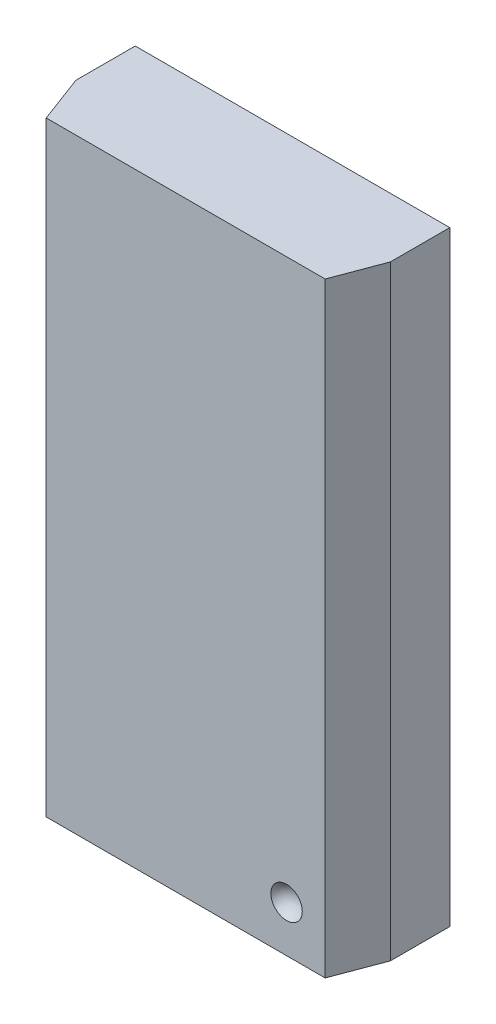
ISO-10303-21;
HEADER;
FILE_DESCRIPTION(('STEP AP214'),'2;1');
FILE_NAME('part.step','',(''),(''),'','','');
FILE_SCHEMA(('AUTOMOTIVE_DESIGN { 1 0 10303 214 1 1 1 1 }'));
ENDSEC;
DATA;
#1=APPLICATION_CONTEXT('core data for automotive mechanical design processes');
#2=APPLICATION_PROTOCOL_DEFINITION('international standard','automotive_design',2000,#1);
#3=PRODUCT_CONTEXT('',#1,'mechanical');
#4=PRODUCT('Part','Part','',(#3));
#5=PRODUCT_RELATED_PRODUCT_CATEGORY('part','',(#4));
#6=PRODUCT_DEFINITION_FORMATION('','',#4);
#7=PRODUCT_DEFINITION_CONTEXT('part definition',#1,'design');
#8=PRODUCT_DEFINITION('design','',#6,#7);
#9=PRODUCT_DEFINITION_SHAPE('','',#8);
#10=(LENGTH_UNIT() NAMED_UNIT(*) SI_UNIT(.MILLI.,.METRE.));
#11=(NAMED_UNIT(*) PLANE_ANGLE_UNIT() SI_UNIT($,.RADIAN.));
#12=(NAMED_UNIT(*) SI_UNIT($,.STERADIAN.) SOLID_ANGLE_UNIT());
#13=UNCERTAINTY_MEASURE_WITH_UNIT(LENGTH_MEASURE(1.E-05),#10,'distance_accuracy_value','');
#14=(GEOMETRIC_REPRESENTATION_CONTEXT(3) GLOBAL_UNCERTAINTY_ASSIGNED_CONTEXT((#13)) GLOBAL_UNIT_ASSIGNED_CONTEXT((#10,
#11,#12)) REPRESENTATION_CONTEXT('',''));
#15=CARTESIAN_POINT('',(0.,0.,0.));
#16=DIRECTION('',(0.,0.,1.));
#17=DIRECTION('',(1.,0.,0.));
#18=AXIS2_PLACEMENT_3D('',#15,#16,#17);
#19=CARTESIAN_POINT('',(1.59694277202488,-4.58817753292736,1.87268785101428));
#20=CARTESIAN_POINT('',(1.64216718875779,-4.58817753292736,1.76585007048859));
#21=CARTESIAN_POINT('',(1.75818245081433,-4.58817753292736,1.7659849276044));
#22=CARTESIAN_POINT('',(1.8031583674009,-4.58817753292736,1.87292755775573));
#23=CARTESIAN_POINT('',(1.34005004997247,-4.47097835084961,1.76394519967328));
#24=CARTESIAN_POINT('',(1.49800623473388,-4.47097835084961,1.39079084148934));
#25=CARTESIAN_POINT('',(1.90321495808281,-4.47097835084961,1.39126185951542));
#26=CARTESIAN_POINT('',(2.06030320163315,-4.47097835084961,1.764782427991));
#27=CARTESIAN_POINT('',(1.34156158465533,-4.16840308910263,1.76458503208151));
#28=CARTESIAN_POINT('',(1.498854465389,-4.16840308910263,1.39299765773633));
#29=CARTESIAN_POINT('',(1.90236159928336,-4.16840308910263,1.39346669782052));
#30=CARTESIAN_POINT('',(2.05879018354391,-4.16840308910263,1.76541874463367));
#31=CARTESIAN_POINT('',(1.59961010586653,-4.05423726383752,1.87381693303589));
#32=CARTESIAN_POINT('',(1.64366402131981,-4.05423726383752,1.76974433485755));
#33=CARTESIAN_POINT('',(1.75667656885828,-4.05423726383752,1.76987570159276));
#34=CARTESIAN_POINT('',(1.80048841586208,-4.05423726383752,1.87405043567195));
#35=(BOUNDED_SURFACE() B_SPLINE_SURFACE(3,3,((#19,#20,#21,#22),(#23,#24,#25,#26),(#27,#28,#29,
#30),(#31,#32,#33,#34)),.UNSPECIFIED.,.F.,.F.,.F.) B_SPLINE_SURFACE_WITH_KNOTS((4,4),(4,4),(0.,
1.),(0.,1.),.UNSPECIFIED.) GEOMETRIC_REPRESENTATION_ITEM() RATIONAL_B_SPLINE_SURFACE(((1.,
0.592495595609752,0.592495595609752,1.),(0.588217584838267,0.348516328276879,0.348516328276879,
0.588217584838267),(0.588217584838267,0.348516328276879,0.348516328276879,0.588217584838267),
(1.,0.592495595609752,0.592495595609752,1.))) REPRESENTATION_ITEM('') SURFACE());
#36=CARTESIAN_POINT('',(1.96447842560012,-4.32171313154078,1.80000000000028));
#37=CARTESIAN_POINT('',(1.96447728753263,-4.31838963170653,1.80000001262232));
#38=CARTESIAN_POINT('',(1.96441451224342,-4.315066139045,1.80000245878868));
#39=CARTESIAN_POINT('',(1.96416669474467,-4.3084576558505,1.8000110646047));
#40=CARTESIAN_POINT('',(1.96398290552865,-4.30517261821554,1.80001718614244));
#41=CARTESIAN_POINT('',(1.9634966485052,-4.29864656048071,1.80003195548272));
#42=CARTESIAN_POINT('',(1.9631954669972,-4.29540544451496,1.80004057565314));
#43=CARTESIAN_POINT('',(1.96247839642698,-4.2889723613424,1.80005930785607));
#44=CARTESIAN_POINT('',(1.96206381806036,-4.28578024798487,1.8000694022622));
#45=CARTESIAN_POINT('',(1.96112419202656,-4.27944988685185,1.80009017662881));
#46=CARTESIAN_POINT('',(1.9606004714086,-4.27631144207713,1.80010084850801));
#47=CARTESIAN_POINT('',(1.95944703881737,-4.27009271396852,1.80012200407324));
#48=CARTESIAN_POINT('',(1.95881866225767,-4.26701218294202,1.80013248848755));
#49=CARTESIAN_POINT('',(1.95746058554247,-4.26091315063053,1.80015262353895));
#50=CARTESIAN_POINT('',(1.95673222157607,-4.25789435183175,1.80016228281985));
#51=CARTESIAN_POINT('',(1.95517898520179,-4.25192222399201,1.80018024710359));
#52=CARTESIAN_POINT('',(1.95435544258135,-4.24896854912622,1.80018856761889));
#53=CARTESIAN_POINT('',(1.95261676925393,-4.24312968404578,1.80020345465584));
#54=CARTESIAN_POINT('',(1.95170295525224,-4.24024410177595,1.80021004239447));
#55=CARTESIAN_POINT('',(1.94978872518747,-4.23454401874528,1.80022118025014));
#56=CARTESIAN_POINT('',(1.94878960661037,-4.23172908227304,1.80022575603369));
#57=CARTESIAN_POINT('',(1.94670978201727,-4.22617248013593,1.80023269727542));
#58=CARTESIAN_POINT('',(1.94563034871328,-4.223430338093,1.80023509153108));
#59=CARTESIAN_POINT('',(1.94339490367646,-4.21802112001746,1.80023760246911));
#60=CARTESIAN_POINT('',(1.94224013493323,-4.21535353026608,1.80023774972271));
#61=CARTESIAN_POINT('',(1.93985899118724,-4.21009483384692,1.80023579918783));
#62=CARTESIAN_POINT('',(1.93863382512152,-4.20750317970491,1.80023373237143));
#63=CARTESIAN_POINT('',(1.93611679404825,-4.20239741159925,1.80022748021666));
#64=CARTESIAN_POINT('',(1.93482610021238,-4.1998827201745,1.8002233248835));
#65=CARTESIAN_POINT('',(1.93218283093036,-4.19493159408113,1.80021311041599));
#66=CARTESIAN_POINT('',(1.93083138578946,-4.19249455585088,1.80020707897545));
#67=CARTESIAN_POINT('',(1.92807132043073,-4.18769913420764,1.80019340941177));
#68=CARTESIAN_POINT('',(1.92666378712757,-4.18534012505309,1.80018579536664));
#69=CARTESIAN_POINT('',(1.9237961193707,-4.18070085929119,1.80016933471427));
#70=CARTESIAN_POINT('',(1.92233702652648,-4.17841995872413,1.80016050731443));
#71=CARTESIAN_POINT('',(1.91937067737575,-4.17393674337793,1.80014206485633));
#72=CARTESIAN_POINT('',(1.91786441582027,-4.17173377012607,1.80013246295508));
#73=CARTESIAN_POINT('',(1.91480797477914,-4.16740595164748,1.80011298488993));
#74=CARTESIAN_POINT('',(1.91325874274912,-4.16528043773412,1.80010311468349));
#75=CARTESIAN_POINT('',(1.91012056268004,-4.1611069910638,1.80008366639348));
#76=CARTESIAN_POINT('',(1.90853251253924,-4.15905838097272,1.80007408614963));
#77=CARTESIAN_POINT('',(1.9037492055295,-4.15307090281385,1.80004696250654));
#78=CARTESIAN_POINT('',(1.9004697469792,-4.14919853952155,1.80003056866547));
#79=CARTESIAN_POINT('',(1.89542693363786,-4.14357575552709,1.80001255333211));
#80=CARTESIAN_POINT('',(1.89374471934441,-4.14175171156943,1.80000766344338));
#81=CARTESIAN_POINT('',(1.89035527492868,-4.13817637272944,1.80000160317097));
#82=CARTESIAN_POINT('',(1.88864875193605,-4.13642440902473,1.80000038033407));
#83=CARTESIAN_POINT('',(1.88451028580023,-4.13229075578714,1.79999947064995));
#84=CARTESIAN_POINT('',(1.88205608843532,-4.12993128092376,1.80000057332496));
#85=CARTESIAN_POINT('',(1.87713750802628,-4.12538265832802,1.80000155337605));
#86=CARTESIAN_POINT('',(1.87467592457072,-4.12319048093511,1.80000146855918));
#87=CARTESIAN_POINT('',(1.86975121609557,-4.1189673874296,1.80000084045628));
#88=CARTESIAN_POINT('',(1.86729058158533,-4.11693356685693,1.80000031169454));
#89=CARTESIAN_POINT('',(1.86237476376204,-4.11301854762314,1.799998336808));
#90=CARTESIAN_POINT('',(1.85992179402098,-4.1111345689952,1.7999969197449));
#91=CARTESIAN_POINT('',(1.85502719520591,-4.10751052695507,1.79999318183108));
#92=CARTESIAN_POINT('',(1.85258752102228,-4.10576782278098,1.79999088999917));
#93=CARTESIAN_POINT('',(1.84772427137791,-4.10241780085942,1.79998544213194));
#94=CARTESIAN_POINT('',(1.84530241379946,-4.10080798874107,1.79998231412484));
#95=CARTESIAN_POINT('',(1.84047854357534,-4.0977154315357,1.79997536888789));
#96=CARTESIAN_POINT('',(1.83807803203342,-4.0962303444771,1.79997157456206));
#97=CARTESIAN_POINT('',(1.83329966578405,-4.09337919888772,1.79996356439305));
#98=CARTESIAN_POINT('',(1.83092311512417,-4.09201095432036,1.79995936364479));
#99=CARTESIAN_POINT('',(1.8261946398181,-4.08938575800985,1.79995095309825));
#100=CARTESIAN_POINT('',(1.82384384070561,-4.08812677859218,1.79994674673807));
#101=CARTESIAN_POINT('',(1.81916805227835,-4.08571277592795,1.79993872977672));
#102=CARTESIAN_POINT('',(1.81684402807039,-4.08455588263353,1.79993491164497));
#103=CARTESIAN_POINT('',(1.81222234094477,-4.08233890350286,1.79992863276084));
#104=CARTESIAN_POINT('',(1.80992549767243,-4.08127710937289,1.79992614012346));
#105=CARTESIAN_POINT('',(1.80535788353773,-4.07924421318437,1.79992204544429));
#106=CARTESIAN_POINT('',(1.80308780760194,-4.07827154720477,1.79992042348522));
#107=CARTESIAN_POINT('',(1.79767722141134,-4.07603892870223,1.79992395033207));
#108=CARTESIAN_POINT('',(1.79452555793486,-4.07480590976565,1.79993182768706));
#109=CARTESIAN_POINT('',(1.78832135571542,-4.07250902178397,1.79995986005971));
#110=CARTESIAN_POINT('',(1.78527070095982,-4.07144004977876,1.79997944928028));
#111=CARTESIAN_POINT('',(1.77926114532082,-4.06945481262306,1.80002289724225));
#112=CARTESIAN_POINT('',(1.77630373527828,-4.06853403365823,1.80004654343802));
#113=CARTESIAN_POINT('',(1.77047155045215,-4.06682990116505,1.80009308249294));
#114=CARTESIAN_POINT('',(1.76759791445186,-4.06604265108598,1.80011596977191));
#115=CARTESIAN_POINT('',(1.76192214840442,-4.06459236489603,1.80015653783994));
#116=CARTESIAN_POINT('',(1.75912085918034,-4.06392604443716,1.80017436770419));
#117=CARTESIAN_POINT('',(1.75357701922797,-4.06270611670374,1.8002017691248));
#118=CARTESIAN_POINT('',(1.75083505524894,-4.06214984915314,1.80021156051204));
#119=CARTESIAN_POINT('',(1.74539565653581,-4.06114019875331,1.80022126659007));
#120=CARTESIAN_POINT('',(1.74269859786264,-4.06068479268409,1.80022139732943));
#121=CARTESIAN_POINT('',(1.73733362606573,-4.05986859977837,1.80021183660787));
#122=CARTESIAN_POINT('',(1.73466592169933,-4.05950643744284,1.80020229959591));
#123=CARTESIAN_POINT('',(1.72934330190236,-4.05886996706827,1.80017528499996));
#124=CARTESIAN_POINT('',(1.72668847319052,-4.05859493174945,1.80015787626315));
#125=CARTESIAN_POINT('',(1.72137479716266,-4.05812736678646,1.80011903670423));
#126=CARTESIAN_POINT('',(1.71871595796997,-4.05793474269773,1.80009761052691));
#127=CARTESIAN_POINT('',(1.71066270682943,-4.05747230425462,1.80003575752337));
#128=CARTESIAN_POINT('',(1.70526059375794,-4.05732607517216,1.79999839177467));
#129=CARTESIAN_POINT('',(1.69714409821811,-4.05732929088231,1.80000080856573));
#130=CARTESIAN_POINT('',(1.69442890419356,-4.0573678709316,1.80001146884006));
#131=CARTESIAN_POINT('',(1.68903582681769,-4.05752354232483,1.80004183839399));
#132=CARTESIAN_POINT('',(1.68635791544734,-4.05763961093691,1.8000614287551));
#133=CARTESIAN_POINT('',(1.68102228660717,-4.05795167921069,1.80010164870628));
#134=CARTESIAN_POINT('',(1.67836454181789,-4.05814721347308,1.80012227164261));
#135=CARTESIAN_POINT('',(1.67305176164835,-4.05862101435347,1.80015873061526));
#136=CARTESIAN_POINT('',(1.67039673878764,-4.05889942266967,1.80017455835846));
#137=CARTESIAN_POINT('',(1.66507221024387,-4.05954309771667,1.80019791781358));
#138=CARTESIAN_POINT('',(1.66240279857298,-4.05990914596882,1.80020537123295));
#139=CARTESIAN_POINT('',(1.65703284961224,-4.06073365587095,1.80021049151079));
#140=CARTESIAN_POINT('',(1.6543325323709,-4.06119355231965,1.80020799365786));
#141=CARTESIAN_POINT('',(1.64888499593244,-4.06221282384361,1.80019351148227));
#142=CARTESIAN_POINT('',(1.64613816767734,-4.06277428452413,1.80018130538614));
#143=CARTESIAN_POINT('',(1.64058295767311,-4.06400535291193,1.80014925564922));
#144=CARTESIAN_POINT('',(1.63777518124051,-4.06467768503301,1.80012919522766));
#145=CARTESIAN_POINT('',(1.63208480150131,-4.06614088111347,1.80008456447886));
#146=CARTESIAN_POINT('',(1.62920306110645,-4.06693509465666,1.80005985980988));
#147=CARTESIAN_POINT('',(1.62335305577725,-4.06865418640755,1.80001031015964));
#148=CARTESIAN_POINT('',(1.62038595530577,-4.06958302727127,1.79998549928012));
#149=CARTESIAN_POINT('',(1.61435547054442,-4.07158560234113,1.79994052693302));
#150=CARTESIAN_POINT('',(1.61129360726477,-4.07266391865996,1.79992061861967));
#151=CARTESIAN_POINT('',(1.60506550193075,-4.07498083763565,1.79989311314443));
#152=CARTESIAN_POINT('',(1.60190117780547,-4.07622461082871,1.79988614320591));
#153=CARTESIAN_POINT('',(1.59648540020566,-4.07846973472313,1.79988483599233));
#154=CARTESIAN_POINT('',(1.59422248717997,-4.07944354301104,1.79988754888633));
#155=CARTESIAN_POINT('',(1.58966967613673,-4.08147828097116,1.79989376927941));
#156=CARTESIAN_POINT('',(1.58738046818964,-4.0825407572344,1.79989729456166));
#157=CARTESIAN_POINT('',(1.58277454746101,-4.08475854376306,1.79990567981732));
#158=CARTESIAN_POINT('',(1.58045864732798,-4.08591554128294,1.79991057185992));
#159=CARTESIAN_POINT('',(1.57579963494365,-4.08832912603591,1.79992074365444));
#160=CARTESIAN_POINT('',(1.5734574788928,-4.08958755973857,1.79992603031154));
#161=CARTESIAN_POINT('',(1.56874683390395,-4.09221094549689,1.79993660896536));
#162=CARTESIAN_POINT('',(1.5663794591953,-4.09357789867174,1.79994189692444));
#163=CARTESIAN_POINT('',(1.56161999585176,-4.09642564508946,1.79995207839219));
#164=CARTESIAN_POINT('',(1.55922919723553,-4.09790859488301,1.79995695591667));
#165=CARTESIAN_POINT('',(1.55442529737623,-4.10099595441502,1.79996605547793));
#166=CARTESIAN_POINT('',(1.55201368006104,-4.1026026736421,1.79997025345021));
#167=CARTESIAN_POINT('',(1.54717143443027,-4.10594547226463,1.7999778184759));
#168=CARTESIAN_POINT('',(1.54474250322951,-4.10768401055478,1.79998115599757));
#169=CARTESIAN_POINT('',(1.5398698762256,-4.11129856183645,1.799986950636));
#170=CARTESIAN_POINT('',(1.5374281104735,-4.11317717716404,1.79998937682664));
#171=CARTESIAN_POINT('',(1.5325351297735,-4.11708018295801,1.79999332326076));
#172=CARTESIAN_POINT('',(1.53008609896134,-4.11910731209517,1.79999481212983));
#173=CARTESIAN_POINT('',(1.5251849503557,-4.12331560548431,1.79999729563158));
#174=CARTESIAN_POINT('',(1.52273528856143,-4.12549963028503,1.79999827274461));
#175=CARTESIAN_POINT('',(1.5178407995044,-4.13003039083344,1.79999901095117));
#176=CARTESIAN_POINT('',(1.51539873148983,-4.13238010964625,1.79999873137773));
#177=CARTESIAN_POINT('',(1.51127326241243,-4.13650347924656,1.80000091530177));
#178=CARTESIAN_POINT('',(1.50956798925599,-4.13825531018738,1.80000263651959));
#179=CARTESIAN_POINT('',(1.50618103220596,-4.14183039596865,1.80000960561245));
#180=CARTESIAN_POINT('',(1.50450005663239,-4.1436543202939,1.80001490462973));
#181=CARTESIAN_POINT('',(1.49946089847525,-4.14927683078986,1.80003404257166));
#182=CARTESIAN_POINT('',(1.49618386897366,-4.1531490017354,1.80005102156798));
#183=CARTESIAN_POINT('',(1.49140417251879,-4.15913616979222,1.80007882032973));
#184=CARTESIAN_POINT('',(1.48981730583152,-4.16118471045469,1.8000885929689));
#185=CARTESIAN_POINT('',(1.48668146975714,-4.16535803991047,1.80010836508766));
#186=CARTESIAN_POINT('',(1.48513339991387,-4.16748350679634,1.80011836579036));
#187=CARTESIAN_POINT('',(1.48207925968156,-4.17181125565791,1.80013804911542));
#188=CARTESIAN_POINT('',(1.48057413852108,-4.17401420708135,1.80014772491975));
#189=CARTESIAN_POINT('',(1.47761004649529,-4.17849740599365,1.80016626492453));
#190=CARTESIAN_POINT('',(1.47615207227674,-4.18077831271362,1.80017511518855));
#191=CARTESIAN_POINT('',(1.47328661857439,-4.18541762072762,1.80019157679115));
#192=CARTESIAN_POINT('',(1.47188018271757,-4.18777666672655,1.80019916822538));
#193=CARTESIAN_POINT('',(1.46912229007704,-4.19257219462987,1.80021275333397));
#194=CARTESIAN_POINT('',(1.46777192234372,-4.19500930299874,1.80021872231783));
#195=CARTESIAN_POINT('',(1.46513078727063,-4.19996060441943,1.80022877822308));
#196=CARTESIAN_POINT('',(1.46384115248563,-4.20247540172409,1.80023283692406));
#197=CARTESIAN_POINT('',(1.46132622100579,-4.20758141892366,1.80023886778711));
#198=CARTESIAN_POINT('',(1.46010209784018,-4.21017321692998,1.80024080950442));
#199=CARTESIAN_POINT('',(1.45772302399344,-4.21543224044864,1.80024248746371));
#200=CARTESIAN_POINT('',(1.4565692847078,-4.21810001403567,1.8002421923818));
#201=CARTESIAN_POINT('',(1.45433588577539,-4.22350964088882,1.80023936908035));
#202=CARTESIAN_POINT('',(1.45325747166909,-4.2262520084157,1.80023681002573));
#203=CARTESIAN_POINT('',(1.45117967620034,-4.23180910400533,1.80022952816153));
#204=CARTESIAN_POINT('',(1.45018157018332,-4.23462430892148,1.80022477637817));
#205=CARTESIAN_POINT('',(1.44826935991668,-4.24032497228982,1.80021328118225));
#206=CARTESIAN_POINT('',(1.44735655585767,-4.24321086685451,1.80020651201345));
#207=CARTESIAN_POINT('',(1.44561990140368,-4.24905040047124,1.80019126244977));
#208=CARTESIAN_POINT('',(1.44479737047707,-4.25200443189854,1.80018276083307));
#209=CARTESIAN_POINT('',(1.44324616109355,-4.25797731678278,1.80016444033198));
#210=CARTESIAN_POINT('',(1.44251881523156,-4.26099651629769,1.80015460601279));
#211=CARTESIAN_POINT('',(1.44116278318394,-4.26709639336605,1.80013413248553));
#212=CARTESIAN_POINT('',(1.44053543602389,-4.27017736857464,1.80012348479066));
#213=CARTESIAN_POINT('',(1.43938407571509,-4.27639702715858,1.80010201982696));
#214=CARTESIAN_POINT('',(1.43886140082878,-4.27953595827253,1.8000912020623));
#215=CARTESIAN_POINT('',(1.43792388485362,-4.28586733232517,1.80007015858106));
#216=CARTESIAN_POINT('',(1.43751037365755,-4.28905997221157,1.80005994124898));
#217=CARTESIAN_POINT('',(1.43679546114087,-4.29549414613043,1.80004099124499));
#218=CARTESIAN_POINT('',(1.43649537333551,-4.2987358261641,1.80003227656784));
#219=CARTESIAN_POINT('',(1.43601133244496,-4.30526304644892,1.80001735158137));
#220=CARTESIAN_POINT('',(1.43582866843597,-4.30854868231947,1.80001116933172));
#221=CARTESIAN_POINT('',(1.43558313494502,-4.31515839246057,1.80000248051373));
#222=CARTESIAN_POINT('',(1.43552152117018,-4.31848251349361,1.80000001253604));
#223=CARTESIAN_POINT('',(1.43552155787678,-4.32180661986832,1.8));
#224=B_SPLINE_CURVE_WITH_KNOTS('',3,(#36,#37,#38,#39,#40,#41,#42,#43,#44,#45,#46,#47,#48,#49,
#50,#51,#52,#53,#54,#55,#56,#57,#58,#59,#60,#61,#62,#63,#64,#65,#66,#67,#68,#69,#70,#71,#72,#73,
#74,#75,#76,#77,#78,#79,#80,#81,#82,#83,#84,#85,#86,#87,#88,#89,#90,#91,#92,#93,#94,#95,#96,#97,
#98,#99,#100,#101,#102,#103,#104,#105,#106,#107,#108,#109,#110,#111,#112,#113,#114,#115,#116,
#117,#118,#119,#120,#121,#122,#123,#124,#125,#126,#127,#128,#129,#130,#131,#132,#133,#134,#135,
#136,#137,#138,#139,#140,#141,#142,#143,#144,#145,#146,#147,#148,#149,#150,#151,#152,#153,#154,
#155,#156,#157,#158,#159,#160,#161,#162,#163,#164,#165,#166,#167,#168,#169,#170,#171,#172,#173,
#174,#175,#176,#177,#178,#179,#180,#181,#182,#183,#184,#185,#186,#187,#188,#189,#190,#191,#192,
#193,#194,#195,#196,#197,#198,#199,#200,#201,#202,#203,#204,#205,#206,#207,#208,#209,#210,#211,
#212,#213,#214,#215,#216,#217,#218,#219,#220,#221,#222,#223),.UNSPECIFIED.,.F.,.F.,(4,2,2,2,2,2,
2,2,2,2,2,2,2,2,2,2,2,2,2,2,2,2,2,2,2,2,2,2,2,2,2,2,2,2,2,2,2,2,2,2,2,2,2,2,2,2,2,2,2,2,2,2,2,2,
2,2,2,2,2,2,2,2,2,2,2,2,2,2,2,2,2,2,2,2,2,2,2,2,2,2,2,2,2,2,2,2,2,2,2,2,2,2,2,4),(0.,
0.00996994681120313,0.019838253441854,0.0296013397239781,0.0392560289543843,0.0487995424984408,
0.0582294920678693,0.0675438698751125,0.0767410368790987,0.0858197093447432,0.0947789439411366,
0.103618121601944,0.112336930366164,0.120935347408863,0.129413620460281,0.137772248798198,
0.146011963983612,0.154133710493544,0.162138626388273,0.170028024133283,0.177803371679677,
0.193016908437267,0.200460191912681,0.207796486982701,0.218007163549384,0.227893515312357,
0.237468482098441,0.246745462892873,0.255738230581652,0.264460860901396,0.272927673937384,
0.281153186372725,0.289152072595428,0.296939132709026,0.304529265464787,0.311937444141061,
0.322087875523131,0.331783608526317,0.341074301877529,0.350011398957019,0.358648268159855,
0.367040236703196,0.375244471001956,0.383319670991557,0.391325570830822,0.399322271046716,
0.415523880562741,0.423669546475451,0.431709773076741,0.439703574637635,0.447711123299363,
0.455792928232914,0.464009052714694,0.47241844981339,0.481078473062177,0.490044584795218,
0.499370251840517,0.509106993557923,0.519304533681003,0.526694330460224,0.534264549497014,
0.542029953555879,0.550005232628826,0.558204979754266,0.56664366395271,0.575335598372119,
0.584294901727865,0.593535451148659,0.603070824598738,0.612914231139826,0.623078427429811,
0.630411821343745,0.637852324851061,0.653060719734916,0.660833730305263,0.668720962527806,
0.676723894866757,0.684843849447076,0.693081973117237,0.701439218252697,0.709916323403845,
0.71851379390894,0.727231882609509,0.736070570822401,0.745029549738859,0.754108202436034,
0.763305586699844,0.772620418869388,0.78205105892176,0.791595497021435,0.801251341760002,
0.811015810309253,0.820885720703263,0.830857486452704),.UNSPECIFIED.);
#225=CARTESIAN_POINT('',(1.43552155787679,-4.32180661986832,1.8));
#226=VERTEX_POINT('',#225);
#227=CARTESIAN_POINT('',(1.96447842560009,-4.32171313154078,1.80000000000029));
#228=VERTEX_POINT('',#227);
#229=EDGE_CURVE('E30',#226,#228,#224,.F.);
#230=CARTESIAN_POINT('',(1.43552155787678,-4.32180661986832,1.8));
#231=CARTESIAN_POINT('',(1.43552152097319,-4.32513432538533,1.80000001267427));
#232=CARTESIAN_POINT('',(1.43558326769948,-4.32846204569287,1.80000248739306));
#233=CARTESIAN_POINT('',(1.4358293270654,-4.33507873426998,1.80001119428601));
#234=CARTESIAN_POINT('',(1.43601237505861,-4.33836774968633,1.80001738762909));
#235=CARTESIAN_POINT('',(1.43649742070393,-4.3449015112318,1.80003233089996));
#236=CARTESIAN_POINT('',(1.43679812096634,-4.3481463536997,1.80004105268286));
#237=CARTESIAN_POINT('',(1.43751447305908,-4.35458663929645,1.80006000639251));
#238=CARTESIAN_POINT('',(1.43792880373481,-4.35778222943113,1.80007022036798));
#239=CARTESIAN_POINT('',(1.43886815286966,-4.36411929761219,1.80009124161053));
#240=CARTESIAN_POINT('',(1.43939183450041,-4.36726097384147,1.80010204064106));
#241=CARTESIAN_POINT('',(1.4405453837761,-4.37348592493878,1.80012344918974));
#242=CARTESIAN_POINT('',(1.44117390694686,-4.37656944895573,1.80013405942999));
#243=CARTESIAN_POINT('',(1.44253244965572,-4.38267423609217,1.80015443720018));
#244=CARTESIAN_POINT('',(1.44326112468904,-4.3856957983967,1.80016421349526));
#245=CARTESIAN_POINT('',(1.44481513616297,-4.3916732326816,1.80018239665995));
#246=CARTESIAN_POINT('',(1.44563913526066,-4.39462945231522,1.80019081926859));
#247=CARTESIAN_POINT('',(1.44737885688156,-4.40047319843592,1.80020589048073));
#248=CARTESIAN_POINT('',(1.44829325590886,-4.40336111890712,1.80021256061058));
#249=CARTESIAN_POINT('',(1.45020877596077,-4.4090656830641,1.80022383967242));
#250=CARTESIAN_POINT('',(1.45120859346857,-4.41188276443623,1.80022847464085));
#251=CARTESIAN_POINT('',(1.45328992267876,-4.4174434751478,1.80023550835844));
#252=CARTESIAN_POINT('',(1.45437015638431,-4.42018758283492,1.80023793631399));
#253=CARTESIAN_POINT('',(1.45660729798064,-4.42560056556223,1.8002404876359));
#254=CARTESIAN_POINT('',(1.45776295832147,-4.42826995623803,1.80024064200068));
#255=CARTESIAN_POINT('',(1.46014597212308,-4.43353210272615,1.80023867869577));
#256=CARTESIAN_POINT('',(1.4613721127828,-4.43612540783378,1.80023659242412));
#257=CARTESIAN_POINT('',(1.46389117300388,-4.44123434097287,1.80023027548781));
#258=CARTESIAN_POINT('',(1.46518291819223,-4.44375054815258,1.80022607523493));
#259=CARTESIAN_POINT('',(1.46782836510138,-4.44870458355194,1.80021574723172));
#260=CARTESIAN_POINT('',(1.46918093394014,-4.45114301685343,1.80020964754578));
#261=CARTESIAN_POINT('',(1.47194331828773,-4.45594112075385,1.80019582098148));
#262=CARTESIAN_POINT('',(1.47335204488807,-4.45830141841996,1.80018811850079));
#263=CARTESIAN_POINT('',(1.47622216904998,-4.46294316711299,1.80017146463114));
#264=CARTESIAN_POINT('',(1.4776825235471,-4.46522526320816,1.80016253270509));
#265=CARTESIAN_POINT('',(1.48065146537735,-4.4697107886347,1.80014386994639));
#266=CARTESIAN_POINT('',(1.48215905699796,-4.47191487731331,1.80013415245072));
#267=CARTESIAN_POINT('',(1.48521822834536,-4.47624485809093,1.8001144379881));
#268=CARTESIAN_POINT('',(1.48676886010143,-4.47837141950427,1.80010444707289));
#269=CARTESIAN_POINT('',(1.4899099113551,-4.48254690395793,1.80008475898065));
#270=CARTESIAN_POINT('',(1.49149943284125,-4.48459650470788,1.80007505964528));
#271=CARTESIAN_POINT('',(1.496287289141,-4.49058693471223,1.80004759543006));
#272=CARTESIAN_POINT('',(1.49956992439577,-4.49446115110618,1.80003099181776));
#273=CARTESIAN_POINT('',(1.50461769909944,-4.50008655689535,1.80001273859129));
#274=CARTESIAN_POINT('',(1.50630161978328,-4.5019114794039,1.80000778248215));
#275=CARTESIAN_POINT('',(1.50969455997794,-4.50548855827283,1.80000163552276));
#276=CARTESIAN_POINT('',(1.51140287342483,-4.50724138279531,1.80000039170414));
#277=CARTESIAN_POINT('',(1.51553082893489,-4.51136216706215,1.79999945818449));
#278=CARTESIAN_POINT('',(1.5179721837813,-4.51370843873857,1.80000054673255));
#279=CARTESIAN_POINT('',(1.52286476628212,-4.51823228887475,1.80000146814371));
#280=CARTESIAN_POINT('',(1.52531323202504,-4.52041285663595,1.80000133968678));
#281=CARTESIAN_POINT('',(1.5302115511035,-4.52461429103726,1.80000060452193));
#282=CARTESIAN_POINT('',(1.53265894760361,-4.52663802221899,1.80000001295515));
#283=CARTESIAN_POINT('',(1.53754827549218,-4.53053433797172,1.79999789510872));
#284=CARTESIAN_POINT('',(1.53998802300862,-4.53240966351743,1.79999639838259));
#285=CARTESIAN_POINT('',(1.54485627936588,-4.5360177834461,1.79999248996039));
#286=CARTESIAN_POINT('',(1.54728285926982,-4.53775318094526,1.79999010757889));
#287=CARTESIAN_POINT('',(1.5521201165528,-4.54108987855153,1.7999844742445));
#288=CARTESIAN_POINT('',(1.55452909848761,-4.54269363706971,1.79998125140382));
#289=CARTESIAN_POINT('',(1.55932748684203,-4.54577527985899,1.7999741202389));
#290=CARTESIAN_POINT('',(1.56171541134157,-4.54725547210459,1.79997023467531));
#291=CARTESIAN_POINT('',(1.56646892642688,-4.55009792543229,1.79996205491986));
#292=CARTESIAN_POINT('',(1.56883322916371,-4.5514623407359,1.79995777544546));
#293=CARTESIAN_POINT('',(1.57353756663875,-4.5540808826757,1.79994922966596));
#294=CARTESIAN_POINT('',(1.57587648932321,-4.55533700753773,1.79994496621702));
#295=CARTESIAN_POINT('',(1.58052890045872,-4.55774621637886,1.79993686849502));
#296=CARTESIAN_POINT('',(1.58284143483715,-4.55890114344169,1.79993302587276));
#297=CARTESIAN_POINT('',(1.58744052035064,-4.56111501880382,1.79992673645168));
#298=CARTESIAN_POINT('',(1.58972626064903,-4.56217565111583,1.79992425695736));
#299=CARTESIAN_POINT('',(1.59427203085251,-4.56420697949101,1.79992025177554));
#300=CARTESIAN_POINT('',(1.59653137276788,-4.56517921769508,1.79991870474008));
#301=CARTESIAN_POINT('',(1.60195074647809,-4.56742573865287,1.79992244996481));
#302=CARTESIAN_POINT('',(1.60512240845642,-4.56867206844797,1.79993060700133));
#303=CARTESIAN_POINT('',(1.61136502483549,-4.57099292939248,1.79995936963017));
#304=CARTESIAN_POINT('',(1.61443404347775,-4.57207268204904,1.79997939532237));
#305=CARTESIAN_POINT('',(1.62047885919581,-4.57407724979534,1.80002376939713));
#306=CARTESIAN_POINT('',(1.62345312616426,-4.57500667985488,1.80004789974941));
#307=CARTESIAN_POINT('',(1.62931771034982,-4.57672623479413,1.8000953602579));
#308=CARTESIAN_POINT('',(1.63220685992263,-4.57752034111219,1.80011868551931));
#309=CARTESIAN_POINT('',(1.63791252607849,-4.57898275570475,1.80016000751496));
#310=CARTESIAN_POINT('',(1.64072818136878,-4.57965441786958,1.80017815818125));
#311=CARTESIAN_POINT('',(1.6462998410123,-4.58088368980897,1.8002060288009));
#312=CARTESIAN_POINT('',(1.6490552449279,-4.5814440145929,1.80021597527091));
#313=CARTESIAN_POINT('',(1.65452084261402,-4.58246064075114,1.80022579741498));
#314=CARTESIAN_POINT('',(1.65723065209253,-4.58291900556383,1.80022589544995));
#315=CARTESIAN_POINT('',(1.66262070450881,-4.5837401365948,1.80021608216395));
#316=CARTESIAN_POINT('',(1.66530073433692,-4.5841043042999,1.80020632963953));
#317=CARTESIAN_POINT('',(1.67064780652612,-4.58474393345111,1.80017874447638));
#318=CARTESIAN_POINT('',(1.67331476094932,-4.58502013434806,1.80016098239925));
#319=CARTESIAN_POINT('',(1.67865289170187,-4.58548925727964,1.80012135223997));
#320=CARTESIAN_POINT('',(1.68132405985949,-4.5856822730307,1.80009948881848));
#321=CARTESIAN_POINT('',(1.68668811266144,-4.58598899210902,1.80005771411471));
#322=CARTESIAN_POINT('',(1.6893810267503,-4.58610217908085,1.80003781624485));
#323=CARTESIAN_POINT('',(1.69480595263072,-4.58625189048005,1.80000846474094));
#324=CARTESIAN_POINT('',(1.69753799442439,-4.58628734291903,1.79999915799195));
#325=CARTESIAN_POINT('',(1.70299403840541,-4.58628251248077,1.80000083955253));
#326=CARTESIAN_POINT('',(1.70571804080329,-4.58624245016787,1.80001176875504));
#327=CARTESIAN_POINT('',(1.71112837741411,-4.58608349189676,1.80004312625106));
#328=CARTESIAN_POINT('',(1.71381474218637,-4.58596562457593,1.80006342957318));
#329=CARTESIAN_POINT('',(1.71916716542638,-4.58564959776129,1.80010538953523));
#330=CARTESIAN_POINT('',(1.7218332514595,-4.58545190673351,1.80012703766613));
#331=CARTESIAN_POINT('',(1.72716263444485,-4.58497337450646,1.8001657616012));
#332=CARTESIAN_POINT('',(1.72982591870619,-4.58469239083012,1.80018282947445));
#333=CARTESIAN_POINT('',(1.73516698803792,-4.58404307632648,1.80020878762702));
#334=CARTESIAN_POINT('',(1.73784467792191,-4.5836739581849,1.80021760045215));
#335=CARTESIAN_POINT('',(1.74323128802325,-4.58284273136836,1.80022547302622));
#336=CARTESIAN_POINT('',(1.74593998531626,-4.58237917590263,1.80022436784045));
#337=CARTESIAN_POINT('',(1.75140447991301,-4.58135190110778,1.80021262705578));
#338=CARTESIAN_POINT('',(1.75415988092258,-4.58078607685138,1.80020176724644));
#339=CARTESIAN_POINT('',(1.75973252724918,-4.57954546516541,1.80017229576876));
#340=CARTESIAN_POINT('',(1.76254915838988,-4.57886792561502,1.80015346203103));
#341=CARTESIAN_POINT('',(1.76825762942475,-4.57739334081558,1.80011110460041));
#342=CARTESIAN_POINT('',(1.77114859286624,-4.57659290887118,1.80008743823798));
#343=CARTESIAN_POINT('',(1.77701751329715,-4.57486021949054,1.8000397277403));
#344=CARTESIAN_POINT('',(1.77999428629287,-4.57392395193012,1.80001570676104));
#345=CARTESIAN_POINT('',(1.7860446604718,-4.57190513569822,1.7999720102594));
#346=CARTESIAN_POINT('',(1.78911671341406,-4.57081794576793,1.79995257422038));
#347=CARTESIAN_POINT('',(1.79536581726574,-4.56848164588993,1.79992570373175));
#348=CARTESIAN_POINT('',(1.79854091418557,-4.56722729455829,1.79991888395619));
#349=CARTESIAN_POINT('',(1.80395701043236,-4.5649703215294,1.79991738559634));
#350=CARTESIAN_POINT('',(1.80620983803908,-4.56399597895876,1.79991983437787));
#351=CARTESIAN_POINT('',(1.81074299948721,-4.56196020265418,1.79992515631426));
#352=CARTESIAN_POINT('',(1.81302263463647,-4.5608972105032,1.79992803847043));
#353=CARTESIAN_POINT('',(1.81760994359583,-4.55867842384298,1.79993486537572));
#354=CARTESIAN_POINT('',(1.81991679578172,-4.55752093109858,1.7999388359004));
#355=CARTESIAN_POINT('',(1.82455825388781,-4.55510637342353,1.79994695734558));
#356=CARTESIAN_POINT('',(1.82689189403083,-4.55384745129524,1.79995111023015));
#357=CARTESIAN_POINT('',(1.83158605952237,-4.55122309158588,1.79995928601005));
#358=CARTESIAN_POINT('',(1.83394546048946,-4.54985564247942,1.79996330184441));
#359=CARTESIAN_POINT('',(1.83868954027044,-4.54700688685891,1.79997087229953));
#360=CARTESIAN_POINT('',(1.84107291825332,-4.54552341354432,1.79997440986105));
#361=CARTESIAN_POINT('',(1.84586255369526,-4.54243496432852,1.79998083168134));
#362=CARTESIAN_POINT('',(1.84826731566104,-4.54082766870868,1.79998369289306));
#363=CARTESIAN_POINT('',(1.85309644126734,-4.53748364333566,1.79998865597332));
#364=CARTESIAN_POINT('',(1.85551909534054,-4.53574444430465,1.79999073150748));
#365=CARTESIAN_POINT('',(1.86037977248523,-4.53212845915218,1.7999941429456));
#366=CARTESIAN_POINT('',(1.86281585198028,-4.53024905996199,1.79999545334111));
#367=CARTESIAN_POINT('',(1.86769807895406,-4.52634432962412,1.79999738396908));
#368=CARTESIAN_POINT('',(1.87014202751085,-4.52431624856467,1.79999798063395));
#369=CARTESIAN_POINT('',(1.87503363781956,-4.52010583644413,1.7999989549728));
#370=CARTESIAN_POINT('',(1.87747882710566,-4.51792063273755,1.79999932487989));
#371=CARTESIAN_POINT('',(1.88236502157469,-4.51338725458782,1.79999925271448));
#372=CARTESIAN_POINT('',(1.88480324960105,-4.51103608453497,1.79999878356396));
#373=CARTESIAN_POINT('',(1.88892206127071,-4.50691057544052,1.80000087758855));
#374=CARTESIAN_POINT('',(1.8906244998352,-4.50515799320957,1.80000263248977));
#375=CARTESIAN_POINT('',(1.89400565514393,-4.50158159959751,1.80000965746183));
#376=CARTESIAN_POINT('',(1.89568366653176,-4.49975712291536,1.8000149782971));
#377=CARTESIAN_POINT('',(1.90071356989135,-4.49413341457119,1.80003421122036));
#378=CARTESIAN_POINT('',(1.90398436680387,-4.49026080209281,1.80005129361724));
#379=CARTESIAN_POINT('',(1.90875464953577,-4.48427348136691,1.80007925461066));
#380=CARTESIAN_POINT('',(1.91033827966598,-4.48222505379526,1.80008908276362));
#381=CARTESIAN_POINT('',(1.91346758090457,-4.47805217595855,1.80010896753124));
#382=CARTESIAN_POINT('',(1.91501235599194,-4.47592705159235,1.80011902538348));
#383=CARTESIAN_POINT('',(1.91805986362052,-4.47160021419294,1.80013882047103));
#384=CARTESIAN_POINT('',(1.91956165049573,-4.4693978355317,1.80014855086335));
#385=CARTESIAN_POINT('',(1.92251905030563,-4.4649160082405,1.80016719483796));
#386=CARTESIAN_POINT('',(1.92397367015168,-4.46263590401452,1.80017609443503));
#387=CARTESIAN_POINT('',(1.92683241170761,-4.45799842462363,1.80019264703302));
#388=CARTESIAN_POINT('',(1.92823549330482,-4.45564040817594,1.8002002800538));
#389=CARTESIAN_POINT('',(1.93098669480167,-4.45084715846201,1.80021393876502));
#390=CARTESIAN_POINT('',(1.93233372907543,-4.44841130191912,1.80021993966519));
#391=CARTESIAN_POINT('',(1.9349682356894,-4.44346271642954,1.80023004840652));
#392=CARTESIAN_POINT('',(1.9362545787601,-4.44094938616417,1.80023412790607));
#393=CARTESIAN_POINT('',(1.93876298639542,-4.43584650617093,1.80024018844945));
#394=CARTESIAN_POINT('',(1.93998388052351,-4.4332563809968,1.8002421389099));
#395=CARTESIAN_POINT('',(1.94235657675798,-4.42800089469986,1.80024382202283));
#396=CARTESIAN_POINT('',(1.94350717031246,-4.42533498788755,1.80024352320041));
#397=CARTESIAN_POINT('',(1.94573437857235,-4.4199292721136,1.80024068018232));
#398=CARTESIAN_POINT('',(1.94680975027256,-4.41718895099059,1.80023810499443));
#399=CARTESIAN_POINT('',(1.94888158117192,-4.41163610925106,1.80023077924482));
#400=CARTESIAN_POINT('',(1.94987676719148,-4.40882311359457,1.80022599955353));
#401=CARTESIAN_POINT('',(1.95178327595063,-4.40312701087996,1.80021443806817));
#402=CARTESIAN_POINT('',(1.95269330023382,-4.40024346924289,1.80020763037214));
#403=CARTESIAN_POINT('',(1.95442455031896,-4.3944087623719,1.80019229496442));
#404=CARTESIAN_POINT('',(1.95524445789294,-4.39145720602924,1.80018374590523));
#405=CARTESIAN_POINT('',(1.95679059055873,-4.38548936875843,1.80016532396405));
#406=CARTESIAN_POINT('',(1.95751548374129,-4.38247274279169,1.80015543555285));
#407=CARTESIAN_POINT('',(1.95886679299766,-4.37637808480021,1.8001348500851));
#408=CARTESIAN_POINT('',(1.95949187011842,-4.37329975591971,1.80012414449097));
#409=CARTESIAN_POINT('',(1.96063888295129,-4.36708543472896,1.8001025633503));
#410=CARTESIAN_POINT('',(1.96115947980589,-4.36394919529392,1.80009168731422));
#411=CARTESIAN_POINT('',(1.96209303951832,-4.35762322060492,1.80007053088623));
#412=CARTESIAN_POINT('',(1.96250467117164,-4.35443328887307,1.80006025895659));
#413=CARTESIAN_POINT('',(1.96321602848646,-4.3480045173866,1.80004120794165));
#414=CARTESIAN_POINT('',(1.9635144385622,-4.34476553200474,1.80003244701558));
#415=CARTESIAN_POINT('',(1.96399532867798,-4.33824365652662,1.80001744293906));
#416=CARTESIAN_POINT('',(1.9641765167788,-4.33496067114363,1.80001122811501));
#417=CARTESIAN_POINT('',(1.96441930028038,-4.32835618647004,1.80000249342285));
#418=CARTESIAN_POINT('',(1.96447963629548,-4.32503464076636,1.80000001253123));
#419=CARTESIAN_POINT('',(1.96447842560012,-4.32171313154078,1.80000000000028));
#420=B_SPLINE_CURVE_WITH_KNOTS('',3,(#230,#231,#232,#233,#234,#235,#236,#237,#238,#239,#240,
#241,#242,#243,#244,#245,#246,#247,#248,#249,#250,#251,#252,#253,#254,#255,#256,#257,#258,#259,
#260,#261,#262,#263,#264,#265,#266,#267,#268,#269,#270,#271,#272,#273,#274,#275,#276,#277,#278,
#279,#280,#281,#282,#283,#284,#285,#286,#287,#288,#289,#290,#291,#292,#293,#294,#295,#296,#297,
#298,#299,#300,#301,#302,#303,#304,#305,#306,#307,#308,#309,#310,#311,#312,#313,#314,#315,#316,
#317,#318,#319,#320,#321,#322,#323,#324,#325,#326,#327,#328,#329,#330,#331,#332,#333,#334,#335,
#336,#337,#338,#339,#340,#341,#342,#343,#344,#345,#346,#347,#348,#349,#350,#351,#352,#353,#354,
#355,#356,#357,#358,#359,#360,#361,#362,#363,#364,#365,#366,#367,#368,#369,#370,#371,#372,#373,
#374,#375,#376,#377,#378,#379,#380,#381,#382,#383,#384,#385,#386,#387,#388,#389,#390,#391,#392,
#393,#394,#395,#396,#397,#398,#399,#400,#401,#402,#403,#404,#405,#406,#407,#408,#409,#410,#411,
#412,#413,#414,#415,#416,#417,#418,#419),.UNSPECIFIED.,.F.,.F.,(4,2,2,2,2,2,2,2,2,2,2,2,2,2,2,2,
2,2,2,2,2,2,2,2,2,2,2,2,2,2,2,2,2,2,2,2,2,2,2,2,2,2,2,2,2,2,2,2,2,2,2,2,2,2,2,2,2,2,2,2,2,2,2,2,
2,2,2,2,2,2,2,2,2,2,2,2,2,2,2,2,2,2,2,2,2,2,2,2,2,2,2,2,2,2,4),(0.,0.0099825614937767,
0.0198626519093181,0.0296367301590854,0.0393016618752575,0.0488547135698336,0.0582935444687611,
0.0676161962277926,0.076821080749539,0.0859069663278659,0.0948729623478409,0.103718502767337,
0.112443328600312,0.12104746961273,0.12953122543022,0.137895146242677,0.146140013275564,
0.154266819181279,0.162276748486881,0.170171158217391,0.177951558797076,0.193175480373888,
0.200624171681914,0.207966061676756,0.218121557534655,0.227955392550496,0.237480497393798,
0.246710236582489,0.255658325115786,0.264338758965596,0.272765757783011,0.280953718053732,
0.288917174853757,0.296670770308076,0.30422922683861,0.311607323304699,0.321828135019765,
0.331586531797967,0.340933205094917,0.349920605451381,0.358603091613316,0.367036971157432,
0.3752803842407,0.383392996789561,0.391435495325247,0.399468909340132,0.407553820696021,
0.415749542719716,0.423921363672303,0.431987254867983,0.440006481800013,0.448039506045175,
0.456147167775222,0.464389905087753,0.472827091189361,0.48151654629094,0.49051424737129,
0.499874225825606,0.509648618078945,0.519887820470201,0.527250477688391,0.534795314542531,
0.542537115015356,0.550490595871758,0.558670384150299,0.567090991578367,0.575766783997069,
0.584711943874094,0.593940424006956,0.603465890573844,0.613301653776936,0.623460584449766,
0.630789667880394,0.638225368807232,0.653422727786936,0.661189530265447,0.669070119962145,
0.677065997690776,0.685178511137042,0.693408835917337,0.701757956362035,0.710226646124928,
0.718815448737204,0.727524658241151,0.736354300055658,0.745304112241777,0.754373527351879,
0.763561655059654,0.772867265779861,0.782288775495825,0.79182423201848,0.801471302903,
0.811227265246976,0.821088997587485,0.831052974102795),.UNSPECIFIED.);
#421=EDGE_CURVE('E11',#228,#226,#420,.F.);
#422=ORIENTED_EDGE('',*,*,#229,.F.);
#423=ORIENTED_EDGE('',*,*,#421,.F.);
#424=EDGE_LOOP('',(#422,#423));
#425=FACE_BOUND('',#424,.T.);
#426=ADVANCED_FACE('F17',(#425),#35,.F.);
#427=CARTESIAN_POINT('',(2.35,0.,1.8));
#428=DIRECTION('',(0.936329177569045,0.,0.351123441588392));
#429=DIRECTION('',(0.,-1.,0.));
#430=AXIS2_PLACEMENT_3D('',#427,#428,#429);
#431=PLANE('',#430);
#432=DIRECTION('',(-0.351123441588392,0.,0.936329177569044));
#433=VECTOR('',#432,1.);
#434=CARTESIAN_POINT('',(2.35,5.1,1.8));
#435=LINE('',#434,#433);
#436=CARTESIAN_POINT('',(2.65,5.1,1.));
#437=VERTEX_POINT('',#436);
#438=CARTESIAN_POINT('',(2.35,5.1,1.8));
#439=VERTEX_POINT('',#438);
#440=EDGE_CURVE('E111',#437,#439,#435,.T.);
#441=ORIENTED_EDGE('',*,*,#440,.T.);
#442=DIRECTION('',(0.,1.,0.));
#443=VECTOR('',#442,1.);
#444=CARTESIAN_POINT('',(2.35,0.,1.8));
#445=LINE('',#444,#443);
#446=CARTESIAN_POINT('',(2.35,-5.1,1.8));
#447=VERTEX_POINT('',#446);
#448=EDGE_CURVE('E176',#447,#439,#445,.T.);
#449=ORIENTED_EDGE('',*,*,#448,.F.);
#450=DIRECTION('',(0.351123441588392,0.,-0.936329177569044));
#451=VECTOR('',#450,1.);
#452=CARTESIAN_POINT('',(2.35,-5.1,1.8));
#453=LINE('',#452,#451);
#454=CARTESIAN_POINT('',(2.65,-5.1,1.));
#455=VERTEX_POINT('',#454);
#456=EDGE_CURVE('E157',#447,#455,#453,.T.);
#457=ORIENTED_EDGE('',*,*,#456,.T.);
#458=DIRECTION('',(0.,1.,0.));
#459=VECTOR('',#458,1.);
#460=CARTESIAN_POINT('',(2.65,-5.1,1.));
#461=LINE('',#460,#459);
#462=EDGE_CURVE('E115',#455,#437,#461,.T.);
#463=ORIENTED_EDGE('',*,*,#462,.T.);
#464=EDGE_LOOP('',(#441,#449,#457,#463));
#465=FACE_BOUND('',#464,.T.);
#466=ADVANCED_FACE('F193',(#465),#431,.T.);
#467=CARTESIAN_POINT('',(0.,0.,1.8));
#468=DIRECTION('',(0.,0.,1.));
#469=DIRECTION('',(1.,0.,0.));
#470=AXIS2_PLACEMENT_3D('',#467,#468,#469);
#471=PLANE('',#470);
#472=ORIENTED_EDGE('',*,*,#229,.T.);
#473=ORIENTED_EDGE('',*,*,#421,.T.);
#474=EDGE_LOOP('',(#472,#473));
#475=FACE_BOUND('',#474,.T.);
#476=DIRECTION('',(1.,0.,0.));
#477=VECTOR('',#476,1.);
#478=CARTESIAN_POINT('',(-2.65,-5.1,1.8));
#479=LINE('',#478,#477);
#480=CARTESIAN_POINT('',(-2.35,-5.1,1.8));
#481=VERTEX_POINT('',#480);
#482=EDGE_CURVE('E169',#481,#447,#479,.T.);
#483=ORIENTED_EDGE('',*,*,#482,.T.);
#484=ORIENTED_EDGE('',*,*,#448,.T.);
#485=DIRECTION('',(-1.,0.,0.));
#486=VECTOR('',#485,1.);
#487=CARTESIAN_POINT('',(2.65,5.1,1.8));
#488=LINE('',#487,#486);
#489=CARTESIAN_POINT('',(-2.35,5.1,1.8));
#490=VERTEX_POINT('',#489);
#491=EDGE_CURVE('E149',#439,#490,#488,.T.);
#492=ORIENTED_EDGE('',*,*,#491,.T.);
#493=DIRECTION('',(0.,1.,0.));
#494=VECTOR('',#493,1.);
#495=CARTESIAN_POINT('',(-2.35,0.,1.8));
#496=LINE('',#495,#494);
#497=EDGE_CURVE('E173',#481,#490,#496,.T.);
#498=ORIENTED_EDGE('',*,*,#497,.F.);
#499=EDGE_LOOP('',(#483,#484,#492,#498));
#500=FACE_BOUND('',#499,.T.);
#501=ADVANCED_FACE('F183',(#475,#500),#471,.T.);
#502=CARTESIAN_POINT('',(-2.35,0.,1.8));
#503=DIRECTION('',(-0.936329177569045,0.,0.351123441588392));
#504=DIRECTION('',(0.,1.,0.));
#505=AXIS2_PLACEMENT_3D('',#502,#503,#504);
#506=PLANE('',#505);
#507=DIRECTION('',(0.351123441588392,0.,0.936329177569044));
#508=VECTOR('',#507,1.);
#509=CARTESIAN_POINT('',(-2.65,-5.1,1.));
#510=LINE('',#509,#508);
#511=CARTESIAN_POINT('',(-2.65,-5.1,1.));
#512=VERTEX_POINT('',#511);
#513=EDGE_CURVE('E153',#512,#481,#510,.T.);
#514=ORIENTED_EDGE('',*,*,#513,.T.);
#515=ORIENTED_EDGE('',*,*,#497,.T.);
#516=DIRECTION('',(-0.351123441588392,0.,-0.936329177569044));
#517=VECTOR('',#516,1.);
#518=CARTESIAN_POINT('',(-2.35,5.1,1.8));
#519=LINE('',#518,#517);
#520=CARTESIAN_POINT('',(-2.65,5.1,1.));
#521=VERTEX_POINT('',#520);
#522=EDGE_CURVE('E146',#490,#521,#519,.T.);
#523=ORIENTED_EDGE('',*,*,#522,.T.);
#524=DIRECTION('',(0.,-1.,0.));
#525=VECTOR('',#524,1.);
#526=CARTESIAN_POINT('',(-2.65,5.1,1.));
#527=LINE('',#526,#525);
#528=EDGE_CURVE('E142',#521,#512,#527,.T.);
#529=ORIENTED_EDGE('',*,*,#528,.T.);
#530=EDGE_LOOP('',(#514,#515,#523,#529));
#531=FACE_BOUND('',#530,.T.);
#532=ADVANCED_FACE('F192',(#531),#506,.T.);
#533=CARTESIAN_POINT('',(-2.65,-5.1,1.8));
#534=DIRECTION('',(0.,1.,0.));
#535=DIRECTION('',(1.,0.,0.));
#536=AXIS2_PLACEMENT_3D('',#533,#534,#535);
#537=PLANE('',#536);
#538=ORIENTED_EDGE('',*,*,#513,.F.);
#539=DIRECTION('',(0.,0.,-1.));
#540=VECTOR('',#539,1.);
#541=CARTESIAN_POINT('',(-2.65,-5.1,1.8));
#542=LINE('',#541,#540);
#543=CARTESIAN_POINT('',(-2.65,-5.1,0.));
#544=VERTEX_POINT('',#543);
#545=EDGE_CURVE('E150',#512,#544,#542,.T.);
#546=ORIENTED_EDGE('',*,*,#545,.T.);
#547=DIRECTION('',(1.,0.,0.));
#548=VECTOR('',#547,1.);
#549=CARTESIAN_POINT('',(0.,-5.1,0.));
#550=LINE('',#549,#548);
#551=CARTESIAN_POINT('',(2.65,-5.1,0.));
#552=VERTEX_POINT('',#551);
#553=EDGE_CURVE('E126',#544,#552,#550,.T.);
#554=ORIENTED_EDGE('',*,*,#553,.T.);
#555=DIRECTION('',(0.,0.,1.));
#556=VECTOR('',#555,1.);
#557=CARTESIAN_POINT('',(2.65,-5.1,1.8));
#558=LINE('',#557,#556);
#559=EDGE_CURVE('E121',#552,#455,#558,.T.);
#560=ORIENTED_EDGE('',*,*,#559,.T.);
#561=ORIENTED_EDGE('',*,*,#456,.F.);
#562=ORIENTED_EDGE('',*,*,#482,.F.);
#563=EDGE_LOOP('',(#538,#546,#554,#560,#561,#562));
#564=FACE_BOUND('',#563,.T.);
#565=ADVANCED_FACE('F359',(#564),#537,.F.);
#566=CARTESIAN_POINT('',(2.65,-5.1,1.8));
#567=DIRECTION('',(-1.,0.,0.));
#568=DIRECTION('',(0.,1.,0.));
#569=AXIS2_PLACEMENT_3D('',#566,#567,#568);
#570=PLANE('',#569);
#571=ORIENTED_EDGE('',*,*,#462,.F.);
#572=ORIENTED_EDGE('',*,*,#559,.F.);
#573=DIRECTION('',(0.,1.,0.));
#574=VECTOR('',#573,1.);
#575=CARTESIAN_POINT('',(2.65,0.,0.));
#576=LINE('',#575,#574);
#577=CARTESIAN_POINT('',(2.65,5.1,0.));
#578=VERTEX_POINT('',#577);
#579=EDGE_CURVE('E118',#552,#578,#576,.T.);
#580=ORIENTED_EDGE('',*,*,#579,.T.);
#581=DIRECTION('',(0.,0.,1.));
#582=VECTOR('',#581,1.);
#583=CARTESIAN_POINT('',(2.65,5.1,1.8));
#584=LINE('',#583,#582);
#585=EDGE_CURVE('E102',#578,#437,#584,.T.);
#586=ORIENTED_EDGE('',*,*,#585,.T.);
#587=EDGE_LOOP('',(#571,#572,#580,#586));
#588=FACE_BOUND('',#587,.T.);
#589=ADVANCED_FACE('F119',(#588),#570,.F.);
#590=CARTESIAN_POINT('',(2.65,5.1,1.8));
#591=DIRECTION('',(0.,-1.,0.));
#592=DIRECTION('',(0.,0.,-1.));
#593=AXIS2_PLACEMENT_3D('',#590,#591,#592);
#594=PLANE('',#593);
#595=ORIENTED_EDGE('',*,*,#522,.F.);
#596=ORIENTED_EDGE('',*,*,#491,.F.);
#597=ORIENTED_EDGE('',*,*,#440,.F.);
#598=ORIENTED_EDGE('',*,*,#585,.F.);
#599=DIRECTION('',(-1.,0.,0.));
#600=VECTOR('',#599,1.);
#601=CARTESIAN_POINT('',(0.,5.1,0.));
#602=LINE('',#601,#600);
#603=CARTESIAN_POINT('',(-2.65,5.1,0.));
#604=VERTEX_POINT('',#603);
#605=EDGE_CURVE('E108',#578,#604,#602,.T.);
#606=ORIENTED_EDGE('',*,*,#605,.T.);
#607=DIRECTION('',(0.,0.,1.));
#608=VECTOR('',#607,1.);
#609=CARTESIAN_POINT('',(-2.65,5.1,1.8));
#610=LINE('',#609,#608);
#611=EDGE_CURVE('E138',#604,#521,#610,.T.);
#612=ORIENTED_EDGE('',*,*,#611,.T.);
#613=EDGE_LOOP('',(#595,#596,#597,#598,#606,#612));
#614=FACE_BOUND('',#613,.T.);
#615=ADVANCED_FACE('F105',(#614),#594,.F.);
#616=CARTESIAN_POINT('',(-2.65,5.1,1.8));
#617=DIRECTION('',(1.,0.,0.));
#618=DIRECTION('',(0.,-1.,0.));
#619=AXIS2_PLACEMENT_3D('',#616,#617,#618);
#620=PLANE('',#619);
#621=ORIENTED_EDGE('',*,*,#528,.F.);
#622=ORIENTED_EDGE('',*,*,#611,.F.);
#623=DIRECTION('',(0.,-1.,0.));
#624=VECTOR('',#623,1.);
#625=CARTESIAN_POINT('',(-2.65,0.,0.));
#626=LINE('',#625,#624);
#627=EDGE_CURVE('E131',#604,#544,#626,.T.);
#628=ORIENTED_EDGE('',*,*,#627,.T.);
#629=ORIENTED_EDGE('',*,*,#545,.F.);
#630=EDGE_LOOP('',(#621,#622,#628,#629));
#631=FACE_BOUND('',#630,.T.);
#632=ADVANCED_FACE('F329',(#631),#620,.F.);
#633=CARTESIAN_POINT('',(0.,0.,0.));
#634=DIRECTION('',(0.,0.,1.));
#635=DIRECTION('',(1.,0.,0.));
#636=AXIS2_PLACEMENT_3D('',#633,#634,#635);
#637=PLANE('',#636);
#638=ORIENTED_EDGE('',*,*,#605,.F.);
#639=ORIENTED_EDGE('',*,*,#579,.F.);
#640=ORIENTED_EDGE('',*,*,#553,.F.);
#641=ORIENTED_EDGE('',*,*,#627,.F.);
#642=EDGE_LOOP('',(#638,#639,#640,#641));
#643=FACE_BOUND('',#642,.T.);
#644=ADVANCED_FACE('F129',(#643),#637,.F.);
#645=CLOSED_SHELL('',(#426,#466,#501,#532,#565,#589,#615,#632,#644));
#646=MANIFOLD_SOLID_BREP('B1',#645);
#647=ADVANCED_BREP_SHAPE_REPRESENTATION('',(#18,#646),#14);
#648=SHAPE_DEFINITION_REPRESENTATION(#9,#647);
ENDSEC;
END-ISO-10303-21;
